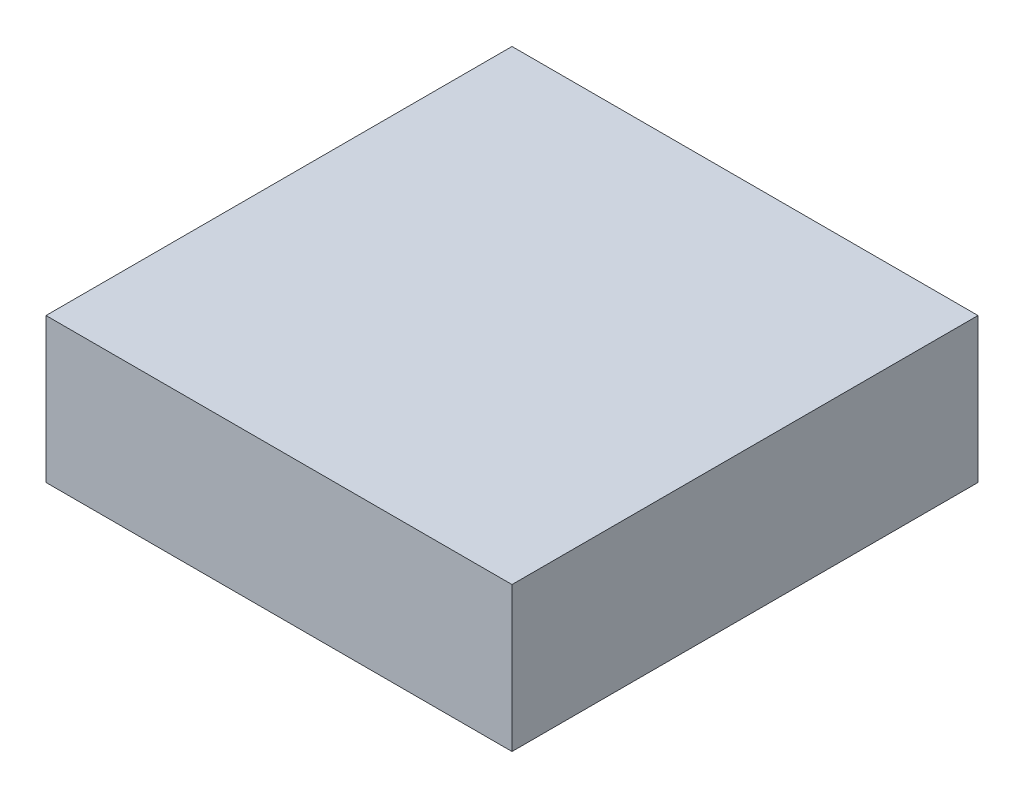
ISO-10303-21;
HEADER;
FILE_DESCRIPTION(('STEP AP214'),'2;1');
FILE_NAME('part.step','',(''),(''),'','','');
FILE_SCHEMA(('AUTOMOTIVE_DESIGN { 1 0 10303 214 1 1 1 1 }'));
ENDSEC;
DATA;
#1=APPLICATION_CONTEXT('core data for automotive mechanical design processes');
#2=APPLICATION_PROTOCOL_DEFINITION('international standard','automotive_design',2000,#1);
#3=PRODUCT_CONTEXT('',#1,'mechanical');
#4=PRODUCT('Part','Part','',(#3));
#5=PRODUCT_RELATED_PRODUCT_CATEGORY('part','',(#4));
#6=PRODUCT_DEFINITION_FORMATION('','',#4);
#7=PRODUCT_DEFINITION_CONTEXT('part definition',#1,'design');
#8=PRODUCT_DEFINITION('design','',#6,#7);
#9=PRODUCT_DEFINITION_SHAPE('','',#8);
#10=(LENGTH_UNIT() NAMED_UNIT(*) SI_UNIT(.MILLI.,.METRE.));
#11=(NAMED_UNIT(*) PLANE_ANGLE_UNIT() SI_UNIT($,.RADIAN.));
#12=(NAMED_UNIT(*) SI_UNIT($,.STERADIAN.) SOLID_ANGLE_UNIT());
#13=UNCERTAINTY_MEASURE_WITH_UNIT(LENGTH_MEASURE(1.E-05),#10,'distance_accuracy_value','');
#14=(GEOMETRIC_REPRESENTATION_CONTEXT(3) GLOBAL_UNCERTAINTY_ASSIGNED_CONTEXT((#13)) GLOBAL_UNIT_ASSIGNED_CONTEXT((#10,
#11,#12)) REPRESENTATION_CONTEXT('',''));
#15=CARTESIAN_POINT('',(0.,0.,0.));
#16=DIRECTION('',(0.,0.,1.));
#17=DIRECTION('',(1.,0.,0.));
#18=AXIS2_PLACEMENT_3D('',#15,#16,#17);
#19=CARTESIAN_POINT('',(72.5,45.,72.5));
#20=DIRECTION('',(-1.,0.,0.));
#21=DIRECTION('',(0.,0.,1.));
#22=AXIS2_PLACEMENT_3D('',#19,#20,#21);
#23=PLANE('',#22);
#24=DIRECTION('',(0.,0.,-1.));
#25=VECTOR('',#24,1.);
#26=CARTESIAN_POINT('',(72.5,0.,72.5));
#27=LINE('',#26,#25);
#28=CARTESIAN_POINT('',(72.5,0.,72.5));
#29=VERTEX_POINT('',#28);
#30=CARTESIAN_POINT('',(72.5,0.,-72.5));
#31=VERTEX_POINT('',#30);
#32=EDGE_CURVE('E107',#29,#31,#27,.T.);
#33=ORIENTED_EDGE('',*,*,#32,.T.);
#34=DIRECTION('',(0.,-1.,0.));
#35=VECTOR('',#34,1.);
#36=CARTESIAN_POINT('',(72.5,45.,-72.5));
#37=LINE('',#36,#35);
#38=CARTESIAN_POINT('',(72.5,45.,-72.5));
#39=VERTEX_POINT('',#38);
#40=EDGE_CURVE('E11',#39,#31,#37,.T.);
#41=ORIENTED_EDGE('',*,*,#40,.F.);
#42=DIRECTION('',(0.,0.,-1.));
#43=VECTOR('',#42,1.);
#44=CARTESIAN_POINT('',(72.5,45.,72.5));
#45=LINE('',#44,#43);
#46=CARTESIAN_POINT('',(72.5,45.,72.5));
#47=VERTEX_POINT('',#46);
#48=EDGE_CURVE('E91',#47,#39,#45,.T.);
#49=ORIENTED_EDGE('',*,*,#48,.F.);
#50=DIRECTION('',(0.,-1.,0.));
#51=VECTOR('',#50,1.);
#52=CARTESIAN_POINT('',(72.5,45.,72.5));
#53=LINE('',#52,#51);
#54=EDGE_CURVE('E103',#47,#29,#53,.T.);
#55=ORIENTED_EDGE('',*,*,#54,.T.);
#56=EDGE_LOOP('',(#33,#41,#49,#55));
#57=FACE_BOUND('',#56,.T.);
#58=ADVANCED_FACE('F39',(#57),#23,.F.);
#59=CARTESIAN_POINT('',(-72.5,45.,-72.5));
#60=DIRECTION('',(0.,0.,1.));
#61=DIRECTION('',(1.,0.,0.));
#62=AXIS2_PLACEMENT_3D('',#59,#60,#61);
#63=PLANE('',#62);
#64=DIRECTION('',(-1.,0.,0.));
#65=VECTOR('',#64,1.);
#66=CARTESIAN_POINT('',(-72.5,0.,-72.5));
#67=LINE('',#66,#65);
#68=CARTESIAN_POINT('',(-72.5,0.,-72.5));
#69=VERTEX_POINT('',#68);
#70=EDGE_CURVE('E96',#31,#69,#67,.T.);
#71=ORIENTED_EDGE('',*,*,#70,.T.);
#72=DIRECTION('',(0.,-1.,0.));
#73=VECTOR('',#72,1.);
#74=CARTESIAN_POINT('',(-72.5,45.,-72.5));
#75=LINE('',#74,#73);
#76=CARTESIAN_POINT('',(-72.5,45.,-72.5));
#77=VERTEX_POINT('',#76);
#78=EDGE_CURVE('E48',#77,#69,#75,.T.);
#79=ORIENTED_EDGE('',*,*,#78,.F.);
#80=DIRECTION('',(-1.,0.,0.));
#81=VECTOR('',#80,1.);
#82=CARTESIAN_POINT('',(-72.5,45.,-72.5));
#83=LINE('',#82,#81);
#84=EDGE_CURVE('E86',#39,#77,#83,.T.);
#85=ORIENTED_EDGE('',*,*,#84,.F.);
#86=ORIENTED_EDGE('',*,*,#40,.T.);
#87=EDGE_LOOP('',(#71,#79,#85,#86));
#88=FACE_BOUND('',#87,.T.);
#89=ADVANCED_FACE('F95',(#88),#63,.F.);
#90=CARTESIAN_POINT('',(-72.5,45.,72.5));
#91=DIRECTION('',(1.,0.,0.));
#92=DIRECTION('',(0.,0.,-1.));
#93=AXIS2_PLACEMENT_3D('',#90,#91,#92);
#94=PLANE('',#93);
#95=DIRECTION('',(0.,0.,1.));
#96=VECTOR('',#95,1.);
#97=CARTESIAN_POINT('',(-72.5,0.,72.5));
#98=LINE('',#97,#96);
#99=CARTESIAN_POINT('',(-72.5,0.,72.5));
#100=VERTEX_POINT('',#99);
#101=EDGE_CURVE('E73',#69,#100,#98,.T.);
#102=ORIENTED_EDGE('',*,*,#101,.T.);
#103=DIRECTION('',(0.,-1.,0.));
#104=VECTOR('',#103,1.);
#105=CARTESIAN_POINT('',(-72.5,45.,72.5));
#106=LINE('',#105,#104);
#107=CARTESIAN_POINT('',(-72.5,45.,72.5));
#108=VERTEX_POINT('',#107);
#109=EDGE_CURVE('E98',#108,#100,#106,.T.);
#110=ORIENTED_EDGE('',*,*,#109,.F.);
#111=DIRECTION('',(0.,0.,1.));
#112=VECTOR('',#111,1.);
#113=CARTESIAN_POINT('',(-72.5,45.,72.5));
#114=LINE('',#113,#112);
#115=EDGE_CURVE('E89',#77,#108,#114,.T.);
#116=ORIENTED_EDGE('',*,*,#115,.F.);
#117=ORIENTED_EDGE('',*,*,#78,.T.);
#118=EDGE_LOOP('',(#102,#110,#116,#117));
#119=FACE_BOUND('',#118,.T.);
#120=ADVANCED_FACE('F99',(#119),#94,.F.);
#121=CARTESIAN_POINT('',(-72.5,45.,72.5));
#122=DIRECTION('',(0.,0.,-1.));
#123=DIRECTION('',(-1.,0.,0.));
#124=AXIS2_PLACEMENT_3D('',#121,#122,#123);
#125=PLANE('',#124);
#126=DIRECTION('',(1.,0.,0.));
#127=VECTOR('',#126,1.);
#128=CARTESIAN_POINT('',(-72.5,0.,72.5));
#129=LINE('',#128,#127);
#130=EDGE_CURVE('E79',#100,#29,#129,.T.);
#131=ORIENTED_EDGE('',*,*,#130,.T.);
#132=ORIENTED_EDGE('',*,*,#54,.F.);
#133=DIRECTION('',(1.,0.,0.));
#134=VECTOR('',#133,1.);
#135=CARTESIAN_POINT('',(-72.5,45.,72.5));
#136=LINE('',#135,#134);
#137=EDGE_CURVE('E56',#108,#47,#136,.T.);
#138=ORIENTED_EDGE('',*,*,#137,.F.);
#139=ORIENTED_EDGE('',*,*,#109,.T.);
#140=EDGE_LOOP('',(#131,#132,#138,#139));
#141=FACE_BOUND('',#140,.T.);
#142=ADVANCED_FACE('F120',(#141),#125,.F.);
#143=CARTESIAN_POINT('',(0.,45.,0.));
#144=DIRECTION('',(0.,-1.,0.));
#145=DIRECTION('',(0.,0.,-1.));
#146=AXIS2_PLACEMENT_3D('',#143,#144,#145);
#147=PLANE('',#146);
#148=ORIENTED_EDGE('',*,*,#48,.T.);
#149=ORIENTED_EDGE('',*,*,#84,.T.);
#150=ORIENTED_EDGE('',*,*,#115,.T.);
#151=ORIENTED_EDGE('',*,*,#137,.T.);
#152=EDGE_LOOP('',(#148,#149,#150,#151));
#153=FACE_BOUND('',#152,.T.);
#154=ADVANCED_FACE('F87',(#153),#147,.F.);
#155=CARTESIAN_POINT('',(0.,0.,0.));
#156=DIRECTION('',(0.,-1.,0.));
#157=DIRECTION('',(0.,0.,-1.));
#158=AXIS2_PLACEMENT_3D('',#155,#156,#157);
#159=PLANE('',#158);
#160=ORIENTED_EDGE('',*,*,#32,.F.);
#161=ORIENTED_EDGE('',*,*,#130,.F.);
#162=ORIENTED_EDGE('',*,*,#101,.F.);
#163=ORIENTED_EDGE('',*,*,#70,.F.);
#164=EDGE_LOOP('',(#160,#161,#162,#163));
#165=FACE_BOUND('',#164,.T.);
#166=ADVANCED_FACE('F123',(#165),#159,.T.);
#167=CLOSED_SHELL('',(#58,#89,#120,#142,#154,#166));
#168=MANIFOLD_SOLID_BREP('B2',#167);
#169=ADVANCED_BREP_SHAPE_REPRESENTATION('',(#18,#168),#14);
#170=SHAPE_DEFINITION_REPRESENTATION(#9,#169);
ENDSEC;
END-ISO-10303-21;
